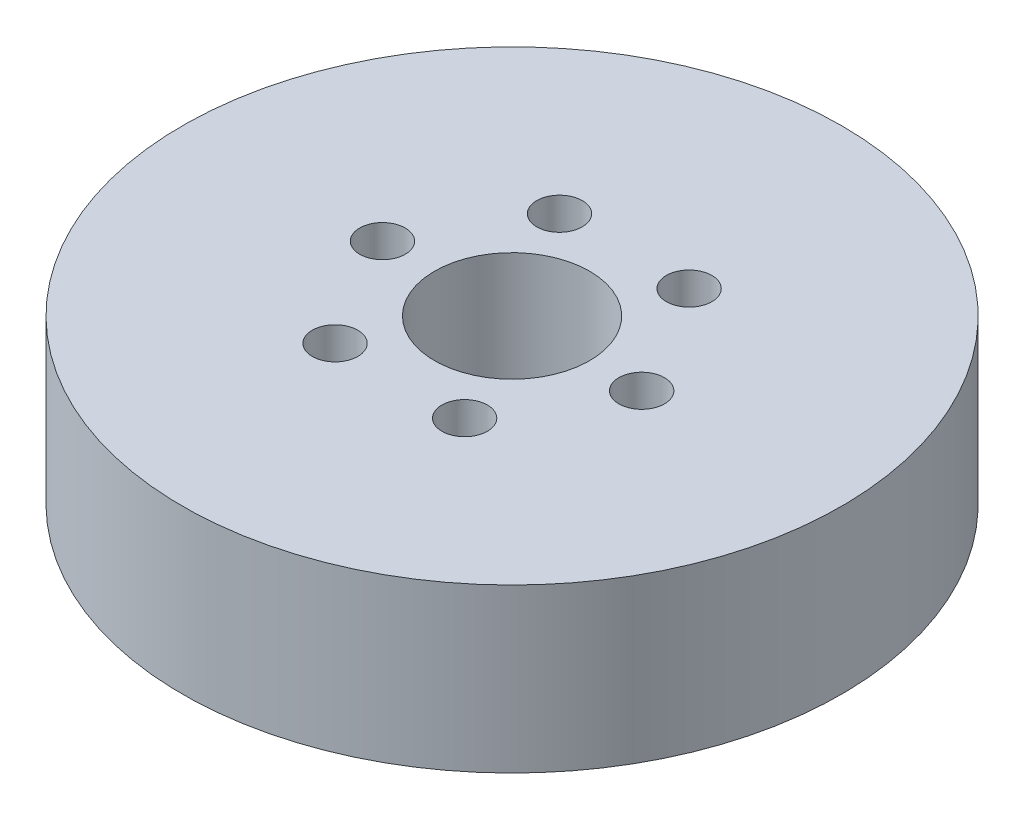
ISO-10303-21;
HEADER;
FILE_DESCRIPTION(('STEP AP214'),'2;1');
FILE_NAME('part.step','',(''),(''),'','','');
FILE_SCHEMA(('AUTOMOTIVE_DESIGN { 1 0 10303 214 1 1 1 1 }'));
ENDSEC;
DATA;
#1=APPLICATION_CONTEXT('core data for automotive mechanical design processes');
#2=APPLICATION_PROTOCOL_DEFINITION('international standard','automotive_design',2000,#1);
#3=PRODUCT_CONTEXT('',#1,'mechanical');
#4=PRODUCT('Part','Part','',(#3));
#5=PRODUCT_RELATED_PRODUCT_CATEGORY('part','',(#4));
#6=PRODUCT_DEFINITION_FORMATION('','',#4);
#7=PRODUCT_DEFINITION_CONTEXT('part definition',#1,'design');
#8=PRODUCT_DEFINITION('design','',#6,#7);
#9=PRODUCT_DEFINITION_SHAPE('','',#8);
#10=(LENGTH_UNIT() NAMED_UNIT(*) SI_UNIT(.MILLI.,.METRE.));
#11=(NAMED_UNIT(*) PLANE_ANGLE_UNIT() SI_UNIT($,.RADIAN.));
#12=(NAMED_UNIT(*) SI_UNIT($,.STERADIAN.) SOLID_ANGLE_UNIT());
#13=UNCERTAINTY_MEASURE_WITH_UNIT(LENGTH_MEASURE(1.E-05),#10,'distance_accuracy_value','');
#14=(GEOMETRIC_REPRESENTATION_CONTEXT(3) GLOBAL_UNCERTAINTY_ASSIGNED_CONTEXT((#13)) GLOBAL_UNIT_ASSIGNED_CONTEXT((#10,
#11,#12)) REPRESENTATION_CONTEXT('',''));
#15=CARTESIAN_POINT('',(0.,0.,0.));
#16=DIRECTION('',(0.,0.,1.));
#17=DIRECTION('',(1.,0.,0.));
#18=AXIS2_PLACEMENT_3D('',#15,#16,#17);
#19=CARTESIAN_POINT('',(0.,21.,0.));
#20=DIRECTION('',(0.,-1.,0.));
#21=DIRECTION('',(0.,0.,-1.));
#22=AXIS2_PLACEMENT_3D('',#19,#20,#21);
#23=CYLINDRICAL_SURFACE('',#22,42.5);
#24=CARTESIAN_POINT('',(0.,21.,0.));
#25=DIRECTION('',(0.,1.,0.));
#26=DIRECTION('',(0.,0.,1.));
#27=AXIS2_PLACEMENT_3D('',#24,#25,#26);
#28=CIRCLE('',#27,42.5);
#29=CARTESIAN_POINT('',(0.,21.,-42.5));
#30=VERTEX_POINT('',#29);
#31=EDGE_CURVE('E10',#30,#30,#28,.T.);
#32=CARTESIAN_POINT('',(0.,0.,0.));
#33=DIRECTION('',(0.,1.,0.));
#34=DIRECTION('',(0.,0.,1.));
#35=AXIS2_PLACEMENT_3D('',#32,#33,#34);
#36=CIRCLE('',#35,42.5);
#37=CARTESIAN_POINT('',(0.,0.,-42.5));
#38=VERTEX_POINT('',#37);
#39=EDGE_CURVE('E37',#38,#38,#36,.T.);
#40=CARTESIAN_POINT('',(0.,21.,-42.5));
#41=CARTESIAN_POINT('',(0.,20.78125,-42.5));
#42=CARTESIAN_POINT('',(0.,20.5625,-42.5));
#43=CARTESIAN_POINT('',(0.,20.125,-42.5));
#44=CARTESIAN_POINT('',(0.,19.90625,-42.5));
#45=CARTESIAN_POINT('',(0.,19.46875,-42.5));
#46=CARTESIAN_POINT('',(0.,19.25,-42.5));
#47=CARTESIAN_POINT('',(0.,18.8125,-42.5));
#48=CARTESIAN_POINT('',(0.,18.59375,-42.5));
#49=CARTESIAN_POINT('',(0.,18.15625,-42.5));
#50=CARTESIAN_POINT('',(0.,17.9375,-42.5));
#51=CARTESIAN_POINT('',(0.,17.5,-42.5));
#52=CARTESIAN_POINT('',(0.,17.28125,-42.5));
#53=CARTESIAN_POINT('',(0.,16.84375,-42.5));
#54=CARTESIAN_POINT('',(0.,16.625,-42.5));
#55=CARTESIAN_POINT('',(0.,16.1875,-42.5));
#56=CARTESIAN_POINT('',(0.,15.96875,-42.5));
#57=CARTESIAN_POINT('',(0.,15.53125,-42.5));
#58=CARTESIAN_POINT('',(0.,15.3125,-42.5));
#59=CARTESIAN_POINT('',(0.,14.875,-42.5));
#60=CARTESIAN_POINT('',(0.,14.65625,-42.5));
#61=CARTESIAN_POINT('',(0.,14.21875,-42.5));
#62=CARTESIAN_POINT('',(0.,14.,-42.5));
#63=CARTESIAN_POINT('',(0.,13.5625,-42.5));
#64=CARTESIAN_POINT('',(0.,13.34375,-42.5));
#65=CARTESIAN_POINT('',(0.,12.90625,-42.5));
#66=CARTESIAN_POINT('',(0.,12.6875,-42.5));
#67=CARTESIAN_POINT('',(0.,12.25,-42.5));
#68=CARTESIAN_POINT('',(0.,12.03125,-42.5));
#69=CARTESIAN_POINT('',(0.,11.59375,-42.5));
#70=CARTESIAN_POINT('',(0.,11.375,-42.5));
#71=CARTESIAN_POINT('',(0.,10.9375,-42.5));
#72=CARTESIAN_POINT('',(0.,10.71875,-42.5));
#73=CARTESIAN_POINT('',(0.,10.28125,-42.5));
#74=CARTESIAN_POINT('',(0.,10.0625,-42.5));
#75=CARTESIAN_POINT('',(0.,9.625,-42.5));
#76=CARTESIAN_POINT('',(0.,9.40625,-42.5));
#77=CARTESIAN_POINT('',(0.,8.96875,-42.5));
#78=CARTESIAN_POINT('',(0.,8.75,-42.5));
#79=CARTESIAN_POINT('',(0.,8.3125,-42.5));
#80=CARTESIAN_POINT('',(0.,8.09375,-42.5));
#81=CARTESIAN_POINT('',(0.,7.65625,-42.5));
#82=CARTESIAN_POINT('',(0.,7.4375,-42.5));
#83=CARTESIAN_POINT('',(0.,7.,-42.5));
#84=CARTESIAN_POINT('',(0.,6.78125,-42.5));
#85=CARTESIAN_POINT('',(0.,6.34375,-42.5));
#86=CARTESIAN_POINT('',(0.,6.125,-42.5));
#87=CARTESIAN_POINT('',(0.,5.6875,-42.5));
#88=CARTESIAN_POINT('',(0.,5.46875,-42.5));
#89=CARTESIAN_POINT('',(0.,5.03125,-42.5));
#90=CARTESIAN_POINT('',(0.,4.8125,-42.5));
#91=CARTESIAN_POINT('',(0.,4.375,-42.5));
#92=CARTESIAN_POINT('',(0.,4.15625,-42.5));
#93=CARTESIAN_POINT('',(0.,3.71875,-42.5));
#94=CARTESIAN_POINT('',(0.,3.5,-42.5));
#95=CARTESIAN_POINT('',(0.,3.0625,-42.5));
#96=CARTESIAN_POINT('',(0.,2.84375,-42.5));
#97=CARTESIAN_POINT('',(0.,2.40625,-42.5));
#98=CARTESIAN_POINT('',(0.,2.1875,-42.5));
#99=CARTESIAN_POINT('',(0.,1.75,-42.5));
#100=CARTESIAN_POINT('',(0.,1.53125,-42.5));
#101=CARTESIAN_POINT('',(0.,1.09375,-42.5));
#102=CARTESIAN_POINT('',(0.,0.875000000000001,-42.5));
#103=CARTESIAN_POINT('',(0.,0.4375,-42.5));
#104=CARTESIAN_POINT('',(0.,0.21875,-42.5));
#105=CARTESIAN_POINT('',(0.,0.,-42.5));
#106=B_SPLINE_CURVE_WITH_KNOTS('',3,(#40,#41,#42,#43,#44,#45,#46,#47,#48,#49,#50,#51,#52,#53,
#54,#55,#56,#57,#58,#59,#60,#61,#62,#63,#64,#65,#66,#67,#68,#69,#70,#71,#72,#73,#74,#75,#76,#77,
#78,#79,#80,#81,#82,#83,#84,#85,#86,#87,#88,#89,#90,#91,#92,#93,#94,#95,#96,#97,#98,#99,#100,
#101,#102,#103,#104,#105),.UNSPECIFIED.,.F.,.F.,(4,2,2,2,2,2,2,2,2,2,2,2,2,2,2,2,2,2,2,2,2,2,2,
2,2,2,2,2,2,2,2,2,4),(0.,0.656249999999997,1.3125,1.96875,2.625,3.28125,3.9375,4.59375,5.25,
5.90625,6.5625,7.21875,7.875,8.53125,9.1875,9.84375,10.5,11.15625,11.8125,12.46875,13.125,
13.78125,14.4375,15.09375,15.75,16.40625,17.0625,17.71875,18.375,19.03125,19.6875,20.34375,21.),.UNSPECIFIED.);
#107=EDGE_CURVE('BSEAM40',#30,#38,#106,.T.);
#108=ORIENTED_EDGE('',*,*,#31,.F.);
#109=ORIENTED_EDGE('',*,*,#39,.T.);
#110=ORIENTED_EDGE('',*,*,#107,.T.);
#111=ORIENTED_EDGE('',*,*,#107,.F.);
#112=EDGE_LOOP('',(#108,#110,#109,#111));
#113=FACE_BOUND('',#112,.T.);
#114=ADVANCED_FACE('F40',(#113),#23,.T.);
#115=CARTESIAN_POINT('',(0.,21.,0.));
#116=DIRECTION('',(0.,1.,0.));
#117=DIRECTION('',(0.,0.,1.));
#118=AXIS2_PLACEMENT_3D('',#115,#116,#117);
#119=PLANE('',#118);
#120=CARTESIAN_POINT('',(-8.35563272015059,21.,-14.4723804006854));
#121=DIRECTION('',(0.,1.,0.));
#122=DIRECTION('',(-0.866025403784433,0.,0.50000000000001));
#123=AXIS2_PLACEMENT_3D('',#120,#121,#122);
#124=CIRCLE('',#123,2.93677054174524);
#125=CARTESIAN_POINT('',(-10.8989506143877,21.,-13.0039951298127));
#126=VERTEX_POINT('',#125);
#127=EDGE_CURVE('E70',#126,#126,#124,.T.);
#128=ORIENTED_EDGE('',*,*,#127,.F.);
#129=EDGE_LOOP('',(#128));
#130=FACE_BOUND('',#129,.T.);
#131=CARTESIAN_POINT('',(8.35563272015028,21.,-14.4723804006855));
#132=DIRECTION('',(0.,1.,0.));
#133=DIRECTION('',(-0.866025403784443,0.,-0.499999999999992));
#134=AXIS2_PLACEMENT_3D('',#131,#132,#133);
#135=CIRCLE('',#134,2.93677054174524);
#136=CARTESIAN_POINT('',(5.8123148259131,21.,-15.9407656715581));
#137=VERTEX_POINT('',#136);
#138=EDGE_CURVE('E71',#137,#137,#135,.T.);
#139=ORIENTED_EDGE('',*,*,#138,.F.);
#140=EDGE_LOOP('',(#139));
#141=FACE_BOUND('',#140,.T.);
#142=CARTESIAN_POINT('',(16.7112654403008,21.,0.));
#143=DIRECTION('',(0.,1.,0.));
#144=DIRECTION('',(0.,0.,-1.));
#145=AXIS2_PLACEMENT_3D('',#142,#143,#144);
#146=CIRCLE('',#145,2.93677054174524);
#147=CARTESIAN_POINT('',(16.7112654403008,21.,-2.93677054174524));
#148=VERTEX_POINT('',#147);
#149=EDGE_CURVE('E78',#148,#148,#146,.T.);
#150=ORIENTED_EDGE('',*,*,#149,.F.);
#151=EDGE_LOOP('',(#150));
#152=FACE_BOUND('',#151,.T.);
#153=CARTESIAN_POINT('',(8.35563272015049,21.,14.4723804006854));
#154=DIRECTION('',(0.,1.,0.));
#155=DIRECTION('',(0.866025403784436,0.,-0.500000000000004));
#156=AXIS2_PLACEMENT_3D('',#153,#154,#155);
#157=CIRCLE('',#156,2.93677054174524);
#158=CARTESIAN_POINT('',(10.8989506143876,21.,13.0039951298128));
#159=VERTEX_POINT('',#158);
#160=EDGE_CURVE('E84',#159,#159,#157,.T.);
#161=ORIENTED_EDGE('',*,*,#160,.F.);
#162=EDGE_LOOP('',(#161));
#163=FACE_BOUND('',#162,.T.);
#164=CARTESIAN_POINT('',(-8.35563272015039,21.,14.4723804006855));
#165=DIRECTION('',(0.,1.,0.));
#166=DIRECTION('',(0.86602540378444,0.,0.499999999999998));
#167=AXIS2_PLACEMENT_3D('',#164,#165,#166);
#168=CIRCLE('',#167,2.93677054174524);
#169=CARTESIAN_POINT('',(-5.81231482591321,21.,15.9407656715581));
#170=VERTEX_POINT('',#169);
#171=EDGE_CURVE('E61',#170,#170,#168,.T.);
#172=ORIENTED_EDGE('',*,*,#171,.F.);
#173=EDGE_LOOP('',(#172));
#174=FACE_BOUND('',#173,.T.);
#175=CARTESIAN_POINT('',(-16.7112654403008,21.,0.));
#176=DIRECTION('',(0.,1.,0.));
#177=DIRECTION('',(0.,0.,1.));
#178=AXIS2_PLACEMENT_3D('',#175,#176,#177);
#179=CIRCLE('',#178,2.93677054174524);
#180=CARTESIAN_POINT('',(-16.7112654403008,21.,2.93677054174524));
#181=VERTEX_POINT('',#180);
#182=EDGE_CURVE('E54',#181,#181,#179,.T.);
#183=ORIENTED_EDGE('',*,*,#182,.F.);
#184=EDGE_LOOP('',(#183));
#185=FACE_BOUND('',#184,.T.);
#186=CARTESIAN_POINT('',(0.,21.,0.));
#187=DIRECTION('',(0.,1.,0.));
#188=DIRECTION('',(0.,0.,1.));
#189=AXIS2_PLACEMENT_3D('',#186,#187,#188);
#190=CIRCLE('',#189,10.);
#191=CARTESIAN_POINT('',(0.,21.,-10.));
#192=VERTEX_POINT('',#191);
#193=EDGE_CURVE('E50',#192,#192,#190,.T.);
#194=ORIENTED_EDGE('',*,*,#193,.F.);
#195=EDGE_LOOP('',(#194));
#196=FACE_BOUND('',#195,.T.);
#197=ORIENTED_EDGE('',*,*,#31,.T.);
#198=EDGE_LOOP('',(#197));
#199=FACE_BOUND('',#198,.T.);
#200=ADVANCED_FACE('F99',(#130,#141,#152,#163,#174,#185,#196,#199),#119,.T.);
#201=CARTESIAN_POINT('',(0.,0.,0.));
#202=DIRECTION('',(0.,1.,0.));
#203=DIRECTION('',(0.,0.,1.));
#204=AXIS2_PLACEMENT_3D('',#201,#202,#203);
#205=PLANE('',#204);
#206=CARTESIAN_POINT('',(0.,0.,0.));
#207=DIRECTION('',(0.,1.,0.));
#208=DIRECTION('',(0.,0.,1.));
#209=AXIS2_PLACEMENT_3D('',#206,#207,#208);
#210=CIRCLE('',#209,10.);
#211=CARTESIAN_POINT('',(0.,0.,-10.));
#212=VERTEX_POINT('',#211);
#213=EDGE_CURVE('E47',#212,#212,#210,.T.);
#214=ORIENTED_EDGE('',*,*,#213,.T.);
#215=EDGE_LOOP('',(#214));
#216=FACE_BOUND('',#215,.T.);
#217=ORIENTED_EDGE('',*,*,#39,.F.);
#218=EDGE_LOOP('',(#217));
#219=FACE_BOUND('',#218,.T.);
#220=ADVANCED_FACE('F103',(#216,#219),#205,.F.);
#221=CARTESIAN_POINT('',(0.,21.,0.));
#222=DIRECTION('',(0.,-1.,0.));
#223=DIRECTION('',(0.,0.,-1.));
#224=AXIS2_PLACEMENT_3D('',#221,#222,#223);
#225=CYLINDRICAL_SURFACE('',#224,10.);
#226=CARTESIAN_POINT('',(0.,21.,-10.));
#227=CARTESIAN_POINT('',(0.,20.78125,-10.));
#228=CARTESIAN_POINT('',(0.,20.5625,-10.));
#229=CARTESIAN_POINT('',(0.,20.125,-10.));
#230=CARTESIAN_POINT('',(0.,19.90625,-10.));
#231=CARTESIAN_POINT('',(0.,19.46875,-10.));
#232=CARTESIAN_POINT('',(0.,19.25,-10.));
#233=CARTESIAN_POINT('',(0.,18.8125,-10.));
#234=CARTESIAN_POINT('',(0.,18.59375,-10.));
#235=CARTESIAN_POINT('',(0.,18.15625,-10.));
#236=CARTESIAN_POINT('',(0.,17.9375,-10.));
#237=CARTESIAN_POINT('',(0.,17.5,-10.));
#238=CARTESIAN_POINT('',(0.,17.28125,-10.));
#239=CARTESIAN_POINT('',(0.,16.84375,-10.));
#240=CARTESIAN_POINT('',(0.,16.625,-10.));
#241=CARTESIAN_POINT('',(0.,16.1875,-10.));
#242=CARTESIAN_POINT('',(0.,15.96875,-10.));
#243=CARTESIAN_POINT('',(0.,15.53125,-10.));
#244=CARTESIAN_POINT('',(0.,15.3125,-10.));
#245=CARTESIAN_POINT('',(0.,14.875,-10.));
#246=CARTESIAN_POINT('',(0.,14.65625,-10.));
#247=CARTESIAN_POINT('',(0.,14.21875,-10.));
#248=CARTESIAN_POINT('',(0.,14.,-10.));
#249=CARTESIAN_POINT('',(0.,13.5625,-10.));
#250=CARTESIAN_POINT('',(0.,13.34375,-10.));
#251=CARTESIAN_POINT('',(0.,12.90625,-10.));
#252=CARTESIAN_POINT('',(0.,12.6875,-10.));
#253=CARTESIAN_POINT('',(0.,12.25,-10.));
#254=CARTESIAN_POINT('',(0.,12.03125,-10.));
#255=CARTESIAN_POINT('',(0.,11.59375,-10.));
#256=CARTESIAN_POINT('',(0.,11.375,-10.));
#257=CARTESIAN_POINT('',(0.,10.9375,-10.));
#258=CARTESIAN_POINT('',(0.,10.71875,-10.));
#259=CARTESIAN_POINT('',(0.,10.28125,-10.));
#260=CARTESIAN_POINT('',(0.,10.0625,-10.));
#261=CARTESIAN_POINT('',(0.,9.625,-10.));
#262=CARTESIAN_POINT('',(0.,9.40625,-10.));
#263=CARTESIAN_POINT('',(0.,8.96875,-10.));
#264=CARTESIAN_POINT('',(0.,8.75,-10.));
#265=CARTESIAN_POINT('',(0.,8.3125,-10.));
#266=CARTESIAN_POINT('',(0.,8.09375,-10.));
#267=CARTESIAN_POINT('',(0.,7.65625,-10.));
#268=CARTESIAN_POINT('',(0.,7.4375,-10.));
#269=CARTESIAN_POINT('',(0.,7.,-10.));
#270=CARTESIAN_POINT('',(0.,6.78125,-10.));
#271=CARTESIAN_POINT('',(0.,6.34375,-10.));
#272=CARTESIAN_POINT('',(0.,6.125,-10.));
#273=CARTESIAN_POINT('',(0.,5.6875,-10.));
#274=CARTESIAN_POINT('',(0.,5.46875,-10.));
#275=CARTESIAN_POINT('',(0.,5.03125,-10.));
#276=CARTESIAN_POINT('',(0.,4.8125,-10.));
#277=CARTESIAN_POINT('',(0.,4.375,-10.));
#278=CARTESIAN_POINT('',(0.,4.15625,-10.));
#279=CARTESIAN_POINT('',(0.,3.71875,-10.));
#280=CARTESIAN_POINT('',(0.,3.5,-10.));
#281=CARTESIAN_POINT('',(0.,3.0625,-10.));
#282=CARTESIAN_POINT('',(0.,2.84375,-10.));
#283=CARTESIAN_POINT('',(0.,2.40625,-10.));
#284=CARTESIAN_POINT('',(0.,2.1875,-10.));
#285=CARTESIAN_POINT('',(0.,1.75,-10.));
#286=CARTESIAN_POINT('',(0.,1.53125,-10.));
#287=CARTESIAN_POINT('',(0.,1.09375,-10.));
#288=CARTESIAN_POINT('',(0.,0.875000000000001,-10.));
#289=CARTESIAN_POINT('',(0.,0.4375,-10.));
#290=CARTESIAN_POINT('',(0.,0.21875,-10.));
#291=CARTESIAN_POINT('',(0.,0.,-10.));
#292=B_SPLINE_CURVE_WITH_KNOTS('',3,(#226,#227,#228,#229,#230,#231,#232,#233,#234,#235,#236,
#237,#238,#239,#240,#241,#242,#243,#244,#245,#246,#247,#248,#249,#250,#251,#252,#253,#254,#255,
#256,#257,#258,#259,#260,#261,#262,#263,#264,#265,#266,#267,#268,#269,#270,#271,#272,#273,#274,
#275,#276,#277,#278,#279,#280,#281,#282,#283,#284,#285,#286,#287,#288,#289,#290,#291),
.UNSPECIFIED.,.F.,.F.,(4,2,2,2,2,2,2,2,2,2,2,2,2,2,2,2,2,2,2,2,2,2,2,2,2,2,2,2,2,2,2,2,4),(0.,
0.656249999999997,1.3125,1.96875,2.625,3.28125,3.9375,4.59375,5.25,5.90625,6.5625,7.21875,7.875,
8.53125,9.1875,9.84375,10.5,11.15625,11.8125,12.46875,13.125,13.78125,14.4375,15.09375,15.75,
16.40625,17.0625,17.71875,18.375,19.03125,19.6875,20.34375,21.),.UNSPECIFIED.);
#293=EDGE_CURVE('BSEAM115',#192,#212,#292,.T.);
#294=ORIENTED_EDGE('',*,*,#193,.T.);
#295=ORIENTED_EDGE('',*,*,#213,.F.);
#296=ORIENTED_EDGE('',*,*,#293,.T.);
#297=ORIENTED_EDGE('',*,*,#293,.F.);
#298=EDGE_LOOP('',(#294,#296,#295,#297));
#299=FACE_BOUND('',#298,.T.);
#300=ADVANCED_FACE('F115',(#299),#225,.F.);
#301=CARTESIAN_POINT('',(-16.7112654403008,1.34817301145471,0.));
#302=DIRECTION('',(0.,1.,0.));
#303=DIRECTION('',(0.,0.,1.));
#304=AXIS2_PLACEMENT_3D('',#301,#302,#303);
#305=CYLINDRICAL_SURFACE('',#304,2.93677054174524);
#306=CARTESIAN_POINT('',(-16.7112654403008,1.34817301145471,0.));
#307=DIRECTION('',(0.,1.,0.));
#308=DIRECTION('',(0.,0.,1.));
#309=AXIS2_PLACEMENT_3D('',#306,#307,#308);
#310=CIRCLE('',#309,2.93677054174524);
#311=CARTESIAN_POINT('',(-16.7112654403008,1.34817301145471,2.93677054174524));
#312=VERTEX_POINT('',#311);
#313=EDGE_CURVE('E55',#312,#312,#310,.T.);
#314=ORIENTED_EDGE('',*,*,#313,.F.);
#315=EDGE_LOOP('',(#314));
#316=FACE_BOUND('',#315,.T.);
#317=ORIENTED_EDGE('',*,*,#182,.T.);
#318=EDGE_LOOP('',(#317));
#319=FACE_BOUND('',#318,.T.);
#320=ADVANCED_FACE('F113',(#316,#319),#305,.F.);
#321=CARTESIAN_POINT('',(-16.7112654403008,1.34817301145471,0.));
#322=DIRECTION('',(0.,1.,0.));
#323=DIRECTION('',(0.,0.,1.));
#324=AXIS2_PLACEMENT_3D('',#321,#322,#323);
#325=PLANE('',#324);
#326=ORIENTED_EDGE('',*,*,#313,.T.);
#327=EDGE_LOOP('',(#326));
#328=FACE_BOUND('',#327,.T.);
#329=ADVANCED_FACE('F144',(#328),#325,.T.);
#330=CARTESIAN_POINT('',(-8.35563272015039,1.34817301145471,14.4723804006855));
#331=DIRECTION('',(0.,1.,0.));
#332=DIRECTION('',(0.,0.,1.));
#333=AXIS2_PLACEMENT_3D('',#330,#331,#332);
#334=CYLINDRICAL_SURFACE('',#333,2.93677054174524);
#335=CARTESIAN_POINT('',(-8.35563272015039,1.34817301145471,14.4723804006855));
#336=DIRECTION('',(0.,1.,0.));
#337=DIRECTION('',(0.86602540378444,0.,0.499999999999998));
#338=AXIS2_PLACEMENT_3D('',#335,#336,#337);
#339=CIRCLE('',#338,2.93677054174524);
#340=CARTESIAN_POINT('',(-5.81231482591321,1.34817301145471,15.9407656715581));
#341=VERTEX_POINT('',#340);
#342=EDGE_CURVE('E59',#341,#341,#339,.T.);
#343=ORIENTED_EDGE('',*,*,#342,.F.);
#344=EDGE_LOOP('',(#343));
#345=FACE_BOUND('',#344,.T.);
#346=ORIENTED_EDGE('',*,*,#171,.T.);
#347=EDGE_LOOP('',(#346));
#348=FACE_BOUND('',#347,.T.);
#349=ADVANCED_FACE('F153',(#345,#348),#334,.F.);
#350=CARTESIAN_POINT('',(-8.35563272015039,1.34817301145471,14.4723804006855));
#351=DIRECTION('',(0.,1.,0.));
#352=DIRECTION('',(0.86602540378444,0.,0.499999999999998));
#353=AXIS2_PLACEMENT_3D('',#350,#351,#352);
#354=PLANE('',#353);
#355=ORIENTED_EDGE('',*,*,#342,.T.);
#356=EDGE_LOOP('',(#355));
#357=FACE_BOUND('',#356,.T.);
#358=ADVANCED_FACE('F96',(#357),#354,.T.);
#359=CARTESIAN_POINT('',(8.35563272015049,1.34817301145471,14.4723804006854));
#360=DIRECTION('',(0.,1.,0.));
#361=DIRECTION('',(0.,0.,1.));
#362=AXIS2_PLACEMENT_3D('',#359,#360,#361);
#363=CYLINDRICAL_SURFACE('',#362,2.93677054174524);
#364=CARTESIAN_POINT('',(8.35563272015049,1.34817301145471,14.4723804006854));
#365=DIRECTION('',(0.,1.,0.));
#366=DIRECTION('',(0.866025403784436,0.,-0.500000000000004));
#367=AXIS2_PLACEMENT_3D('',#364,#365,#366);
#368=CIRCLE('',#367,2.93677054174524);
#369=CARTESIAN_POINT('',(10.8989506143876,1.34817301145471,13.0039951298128));
#370=VERTEX_POINT('',#369);
#371=EDGE_CURVE('E63',#370,#370,#368,.T.);
#372=ORIENTED_EDGE('',*,*,#371,.F.);
#373=EDGE_LOOP('',(#372));
#374=FACE_BOUND('',#373,.T.);
#375=ORIENTED_EDGE('',*,*,#160,.T.);
#376=EDGE_LOOP('',(#375));
#377=FACE_BOUND('',#376,.T.);
#378=ADVANCED_FACE('F91',(#374,#377),#363,.F.);
#379=CARTESIAN_POINT('',(8.35563272015049,1.34817301145471,14.4723804006854));
#380=DIRECTION('',(0.,1.,0.));
#381=DIRECTION('',(0.866025403784436,0.,-0.500000000000004));
#382=AXIS2_PLACEMENT_3D('',#379,#380,#381);
#383=PLANE('',#382);
#384=ORIENTED_EDGE('',*,*,#371,.T.);
#385=EDGE_LOOP('',(#384));
#386=FACE_BOUND('',#385,.T.);
#387=ADVANCED_FACE('F93',(#386),#383,.T.);
#388=CARTESIAN_POINT('',(16.7112654403008,1.34817301145471,0.));
#389=DIRECTION('',(0.,1.,0.));
#390=DIRECTION('',(0.,0.,1.));
#391=AXIS2_PLACEMENT_3D('',#388,#389,#390);
#392=CYLINDRICAL_SURFACE('',#391,2.93677054174524);
#393=CARTESIAN_POINT('',(16.7112654403008,1.34817301145471,0.));
#394=DIRECTION('',(0.,1.,0.));
#395=DIRECTION('',(0.,0.,-1.));
#396=AXIS2_PLACEMENT_3D('',#393,#394,#395);
#397=CIRCLE('',#396,2.93677054174524);
#398=CARTESIAN_POINT('',(16.7112654403008,1.34817301145471,-2.93677054174524));
#399=VERTEX_POINT('',#398);
#400=EDGE_CURVE('E85',#399,#399,#397,.T.);
#401=ORIENTED_EDGE('',*,*,#400,.F.);
#402=EDGE_LOOP('',(#401));
#403=FACE_BOUND('',#402,.T.);
#404=ORIENTED_EDGE('',*,*,#149,.T.);
#405=EDGE_LOOP('',(#404));
#406=FACE_BOUND('',#405,.T.);
#407=ADVANCED_FACE('F187',(#403,#406),#392,.F.);
#408=CARTESIAN_POINT('',(16.7112654403008,1.34817301145471,0.));
#409=DIRECTION('',(0.,1.,0.));
#410=DIRECTION('',(0.,0.,-1.));
#411=AXIS2_PLACEMENT_3D('',#408,#409,#410);
#412=PLANE('',#411);
#413=ORIENTED_EDGE('',*,*,#400,.T.);
#414=EDGE_LOOP('',(#413));
#415=FACE_BOUND('',#414,.T.);
#416=ADVANCED_FACE('F198',(#415),#412,.T.);
#417=CARTESIAN_POINT('',(8.35563272015028,1.34817301145471,-14.4723804006855));
#418=DIRECTION('',(0.,1.,0.));
#419=DIRECTION('',(0.,0.,1.));
#420=AXIS2_PLACEMENT_3D('',#417,#418,#419);
#421=CYLINDRICAL_SURFACE('',#420,2.93677054174524);
#422=CARTESIAN_POINT('',(8.35563272015028,1.34817301145471,-14.4723804006855));
#423=DIRECTION('',(0.,1.,0.));
#424=DIRECTION('',(-0.866025403784443,0.,-0.499999999999992));
#425=AXIS2_PLACEMENT_3D('',#422,#423,#424);
#426=CIRCLE('',#425,2.93677054174524);
#427=CARTESIAN_POINT('',(5.8123148259131,1.34817301145471,-15.9407656715581));
#428=VERTEX_POINT('',#427);
#429=EDGE_CURVE('E76',#428,#428,#426,.T.);
#430=ORIENTED_EDGE('',*,*,#429,.F.);
#431=EDGE_LOOP('',(#430));
#432=FACE_BOUND('',#431,.T.);
#433=ORIENTED_EDGE('',*,*,#138,.T.);
#434=EDGE_LOOP('',(#433));
#435=FACE_BOUND('',#434,.T.);
#436=ADVANCED_FACE('F202',(#432,#435),#421,.F.);
#437=CARTESIAN_POINT('',(8.35563272015028,1.34817301145471,-14.4723804006855));
#438=DIRECTION('',(0.,1.,0.));
#439=DIRECTION('',(-0.866025403784443,0.,-0.499999999999992));
#440=AXIS2_PLACEMENT_3D('',#437,#438,#439);
#441=PLANE('',#440);
#442=ORIENTED_EDGE('',*,*,#429,.T.);
#443=EDGE_LOOP('',(#442));
#444=FACE_BOUND('',#443,.T.);
#445=ADVANCED_FACE('F212',(#444),#441,.T.);
#446=CARTESIAN_POINT('',(-8.35563272015059,1.34817301145471,-14.4723804006854));
#447=DIRECTION('',(0.,1.,0.));
#448=DIRECTION('',(0.,0.,1.));
#449=AXIS2_PLACEMENT_3D('',#446,#447,#448);
#450=CYLINDRICAL_SURFACE('',#449,2.93677054174524);
#451=CARTESIAN_POINT('',(-8.35563272015059,1.34817301145471,-14.4723804006854));
#452=DIRECTION('',(0.,1.,0.));
#453=DIRECTION('',(-0.866025403784433,0.,0.50000000000001));
#454=AXIS2_PLACEMENT_3D('',#451,#452,#453);
#455=CIRCLE('',#454,2.93677054174524);
#456=CARTESIAN_POINT('',(-10.8989506143877,1.34817301145471,-13.0039951298127));
#457=VERTEX_POINT('',#456);
#458=EDGE_CURVE('E69',#457,#457,#455,.T.);
#459=ORIENTED_EDGE('',*,*,#458,.F.);
#460=EDGE_LOOP('',(#459));
#461=FACE_BOUND('',#460,.T.);
#462=ORIENTED_EDGE('',*,*,#127,.T.);
#463=EDGE_LOOP('',(#462));
#464=FACE_BOUND('',#463,.T.);
#465=ADVANCED_FACE('F224',(#461,#464),#450,.F.);
#466=CARTESIAN_POINT('',(-8.35563272015059,1.34817301145471,-14.4723804006854));
#467=DIRECTION('',(0.,1.,0.));
#468=DIRECTION('',(-0.866025403784433,0.,0.50000000000001));
#469=AXIS2_PLACEMENT_3D('',#466,#467,#468);
#470=PLANE('',#469);
#471=ORIENTED_EDGE('',*,*,#458,.T.);
#472=EDGE_LOOP('',(#471));
#473=FACE_BOUND('',#472,.T.);
#474=ADVANCED_FACE('F235',(#473),#470,.T.);
#475=CLOSED_SHELL('',(#114,#200,#220,#300,#320,#329,#349,#358,#378,#387,#407,#416,#436,#445,
#465,#474));
#476=MANIFOLD_SOLID_BREP('B2',#475);
#477=ADVANCED_BREP_SHAPE_REPRESENTATION('',(#18,#476),#14);
#478=SHAPE_DEFINITION_REPRESENTATION(#9,#477);
ENDSEC;
END-ISO-10303-21;
